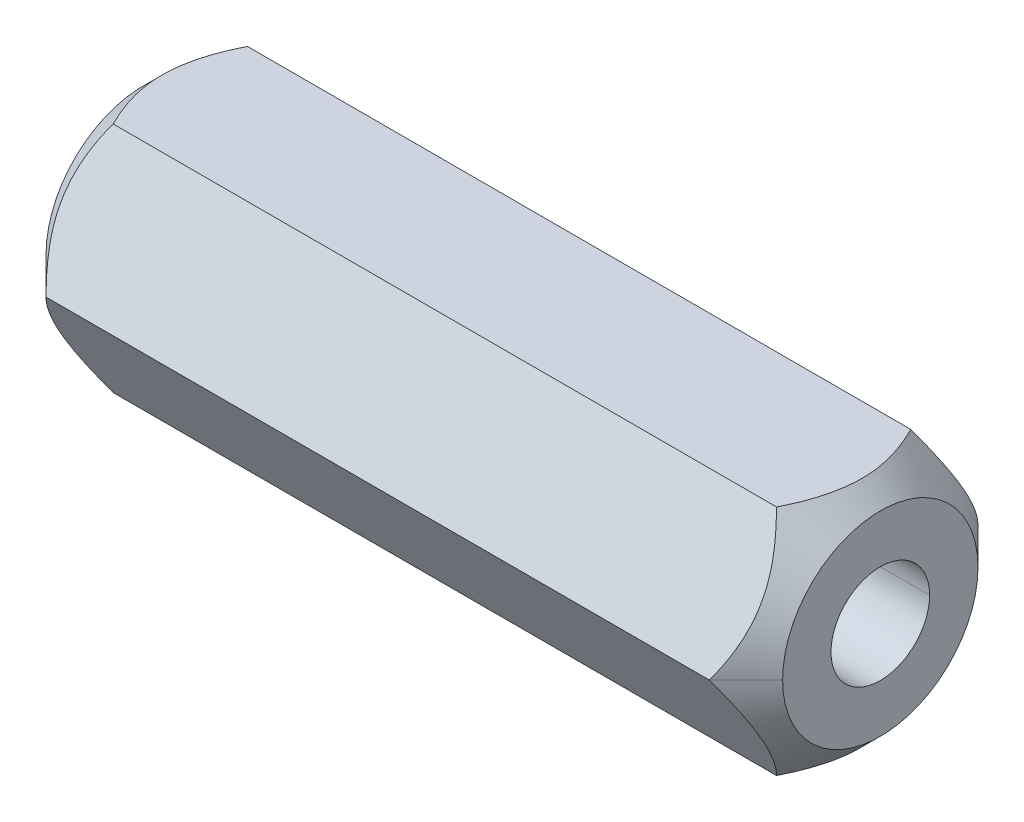
ISO-10303-21;
HEADER;
FILE_DESCRIPTION(('STEP AP214'),'2;1');
FILE_NAME('part.step','',(''),(''),'','','');
FILE_SCHEMA(('AUTOMOTIVE_DESIGN { 1 0 10303 214 1 1 1 1 }'));
ENDSEC;
DATA;
#1=APPLICATION_CONTEXT('core data for automotive mechanical design processes');
#2=APPLICATION_PROTOCOL_DEFINITION('international standard','automotive_design',2000,#1);
#3=PRODUCT_CONTEXT('',#1,'mechanical');
#4=PRODUCT('Part','Part','',(#3));
#5=PRODUCT_RELATED_PRODUCT_CATEGORY('part','',(#4));
#6=PRODUCT_DEFINITION_FORMATION('','',#4);
#7=PRODUCT_DEFINITION_CONTEXT('part definition',#1,'design');
#8=PRODUCT_DEFINITION('design','',#6,#7);
#9=PRODUCT_DEFINITION_SHAPE('','',#8);
#10=(LENGTH_UNIT() NAMED_UNIT(*) SI_UNIT(.MILLI.,.METRE.));
#11=(NAMED_UNIT(*) PLANE_ANGLE_UNIT() SI_UNIT($,.RADIAN.));
#12=(NAMED_UNIT(*) SI_UNIT($,.STERADIAN.) SOLID_ANGLE_UNIT());
#13=UNCERTAINTY_MEASURE_WITH_UNIT(LENGTH_MEASURE(1.E-05),#10,'distance_accuracy_value','');
#14=(GEOMETRIC_REPRESENTATION_CONTEXT(3) GLOBAL_UNCERTAINTY_ASSIGNED_CONTEXT((#13)) GLOBAL_UNIT_ASSIGNED_CONTEXT((#10,
#11,#12)) REPRESENTATION_CONTEXT('',''));
#15=CARTESIAN_POINT('',(0.,0.,0.));
#16=DIRECTION('',(0.,0.,1.));
#17=DIRECTION('',(1.,0.,0.));
#18=AXIS2_PLACEMENT_3D('',#15,#16,#17);
#19=CARTESIAN_POINT('',(15.08125,0.,0.));
#20=DIRECTION('',(-1.,0.,0.));
#21=DIRECTION('',(0.,0.,-1.));
#22=AXIS2_PLACEMENT_3D('',#19,#20,#21);
#23=CONICAL_SURFACE('',#22,4.,0.785398163397452);
#24=DIRECTION('',(-0.707106781186546,0.,0.70710678118655));
#25=VECTOR('',#24,1.);
#26=CARTESIAN_POINT('',(15.08125,0.,4.));
#27=LINE('',#26,#25);
#28=CARTESIAN_POINT('',(15.08125,0.,4.));
#29=VERTEX_POINT('',#28);
#30=CARTESIAN_POINT('',(13.5819886859688,0.,5.49926131403119));
#31=VERTEX_POINT('',#30);
#32=EDGE_CURVE('E331',#29,#31,#27,.T.);
#33=ORIENTED_EDGE('',*,*,#32,.F.);
#34=CARTESIAN_POINT('',(15.08125,0.,0.));
#35=DIRECTION('',(1.,0.,0.));
#36=DIRECTION('',(0.,0.,-1.));
#37=AXIS2_PLACEMENT_3D('',#34,#35,#36);
#38=CIRCLE('',#37,4.);
#39=CARTESIAN_POINT('',(15.08125,0.,-4.));
#40=VERTEX_POINT('',#39);
#41=EDGE_CURVE('E431',#40,#29,#38,.T.);
#42=ORIENTED_EDGE('',*,*,#41,.F.);
#43=DIRECTION('',(-0.707106781186544,0.,-0.707106781186551));
#44=VECTOR('',#43,1.);
#45=CARTESIAN_POINT('',(15.08125,0.,-4.));
#46=LINE('',#45,#44);
#47=CARTESIAN_POINT('',(13.5819886859688,0.,-5.49926131403117));
#48=VERTEX_POINT('',#47);
#49=EDGE_CURVE('E379',#40,#48,#46,.T.);
#50=ORIENTED_EDGE('',*,*,#49,.T.);
#51=CARTESIAN_POINT('',(13.5819886859688,4.76249999999998,-2.74963065701557));
#52=CARTESIAN_POINT('',(13.9295712015046,4.16046942326955,-3.09721317255128));
#53=CARTESIAN_POINT('',(14.1099813082947,3.6157861948308,-3.41168618111346));
#54=CARTESIAN_POINT('',(14.317184713866,2.99021026730595,-3.77286261126849));
#55=CARTESIAN_POINT('',(14.3187392405184,2.39001716223986,-4.11938426204415));
#56=CARTESIAN_POINT('',(14.3202942600487,1.78963376004912,-4.46601578091596));
#57=CARTESIAN_POINT('',(14.1152262690762,1.16264871796632,-4.82800576374033));
#58=CARTESIAN_POINT('',(13.9348623384729,0.611195094788861,-5.14638766152743));
#59=CARTESIAN_POINT('',(13.5819886859689,0.,-5.49926131403116));
#60=B_SPLINE_CURVE_WITH_KNOTS('',2,(#51,#52,#53,#54,#55,#56,#57,#58,#59),.UNSPECIFIED.,.F.,.F.,
(3,2,2,2,3),(0.,0.25,0.5,0.75,1.),.UNSPECIFIED.);
#61=CARTESIAN_POINT('',(13.5819886859688,4.7625,-2.74963065701558));
#62=VERTEX_POINT('',#61);
#63=EDGE_CURVE('E114',#62,#48,#60,.T.);
#64=ORIENTED_EDGE('',*,*,#63,.F.);
#65=CARTESIAN_POINT('',(13.5819886859688,4.76249999999998,2.74963065701558));
#66=CARTESIAN_POINT('',(13.9321394934116,4.76249999999998,2.04932904213029));
#67=CARTESIAN_POINT('',(14.112685608256,4.76249999999999,1.41605997927579));
#68=CARTESIAN_POINT('',(14.3186623628372,4.76249999999999,0.693592445394865));
#69=CARTESIAN_POINT('',(14.3187499997749,4.76249999999999,4.63096649951089E-05));
#70=CARTESIAN_POINT('',(14.3188374802402,4.76249999999999,-0.69226152636333));
#71=CARTESIAN_POINT('',(14.1128194285647,4.76249999999999,-1.41559036912996));
#72=CARTESIAN_POINT('',(13.9325551848368,4.7625,-2.04849765927974));
#73=CARTESIAN_POINT('',(13.5819886859688,4.7625,-2.74963065701558));
#74=B_SPLINE_CURVE_WITH_KNOTS('',2,(#65,#66,#67,#68,#69,#70,#71,#72,#73),.UNSPECIFIED.,.F.,.F.,
(3,2,2,2,3),(0.,0.25,0.5,0.75,1.),.UNSPECIFIED.);
#75=CARTESIAN_POINT('',(13.5819886859688,4.7625,2.74963065701558));
#76=VERTEX_POINT('',#75);
#77=EDGE_CURVE('E306',#76,#62,#74,.T.);
#78=ORIENTED_EDGE('',*,*,#77,.F.);
#79=CARTESIAN_POINT('',(13.5819886859688,0.,5.49926131403118));
#80=CARTESIAN_POINT('',(13.9295712015049,0.602030576730974,5.15167879849517));
#81=CARTESIAN_POINT('',(14.1099813082947,1.1467138051692,4.83720578993329));
#82=CARTESIAN_POINT('',(14.3171847138571,1.77228973266755,4.47602935979357));
#83=CARTESIAN_POINT('',(14.3187392405184,2.37248283776015,4.12950770900261));
#84=CARTESIAN_POINT('',(14.3202942600576,2.97286623992723,3.78287619014446));
#85=CARTESIAN_POINT('',(14.1152262690762,3.5998512820337,3.42088620730642));
#86=CARTESIAN_POINT('',(13.9348623384706,4.15130490521508,3.10250430951706));
#87=CARTESIAN_POINT('',(13.5819886859688,4.76250000000004,2.74963065701558));
#88=B_SPLINE_CURVE_WITH_KNOTS('',2,(#79,#80,#81,#82,#83,#84,#85,#86,#87),.UNSPECIFIED.,.F.,.F.,
(3,2,2,2,3),(0.,0.25,0.5,0.75,1.),.UNSPECIFIED.);
#89=EDGE_CURVE('E305',#31,#76,#88,.T.);
#90=ORIENTED_EDGE('',*,*,#89,.F.);
#91=EDGE_LOOP('',(#33,#42,#50,#64,#78,#90));
#92=FACE_BOUND('',#91,.T.);
#93=ADVANCED_FACE('F16',(#92),#23,.T.);
#94=CARTESIAN_POINT('',(-15.08125,0.,0.));
#95=DIRECTION('',(1.,0.,0.));
#96=DIRECTION('',(0.,0.,-1.));
#97=AXIS2_PLACEMENT_3D('',#94,#95,#96);
#98=CONICAL_SURFACE('',#97,4.,0.785398163397452);
#99=DIRECTION('',(0.707106781186546,0.,0.70710678118655));
#100=VECTOR('',#99,1.);
#101=CARTESIAN_POINT('',(-15.08125,0.,4.));
#102=LINE('',#101,#100);
#103=CARTESIAN_POINT('',(-15.08125,0.,4.));
#104=VERTEX_POINT('',#103);
#105=CARTESIAN_POINT('',(-13.5819886859688,0.,5.49926131403119));
#106=VERTEX_POINT('',#105);
#107=EDGE_CURVE('E309',#104,#106,#102,.T.);
#108=ORIENTED_EDGE('',*,*,#107,.F.);
#109=CARTESIAN_POINT('',(-15.08125,0.,0.));
#110=DIRECTION('',(1.,0.,0.));
#111=DIRECTION('',(0.,0.,-1.));
#112=AXIS2_PLACEMENT_3D('',#109,#110,#111);
#113=CIRCLE('',#112,4.);
#114=CARTESIAN_POINT('',(-15.08125,0.,-4.));
#115=VERTEX_POINT('',#114);
#116=EDGE_CURVE('E125',#104,#115,#113,.T.);
#117=ORIENTED_EDGE('',*,*,#116,.T.);
#118=DIRECTION('',(0.707106781186544,0.,-0.707106781186551));
#119=VECTOR('',#118,1.);
#120=CARTESIAN_POINT('',(-15.08125,0.,-4.));
#121=LINE('',#120,#119);
#122=CARTESIAN_POINT('',(-13.5819886859688,0.,-5.49926131403117));
#123=VERTEX_POINT('',#122);
#124=EDGE_CURVE('E172',#115,#123,#121,.T.);
#125=ORIENTED_EDGE('',*,*,#124,.T.);
#126=CARTESIAN_POINT('',(-13.5819886859689,-4.7625,-2.74963065701564));
#127=CARTESIAN_POINT('',(-13.9295712015054,-4.16046942326812,-3.09721317255218));
#128=CARTESIAN_POINT('',(-14.1099813082947,-3.61578619483082,-3.41168618111352));
#129=CARTESIAN_POINT('',(-14.3171847138593,-2.99021026732507,-3.77286261125752));
#130=CARTESIAN_POINT('',(-14.3187392405184,-2.3900171622399,-4.1193842620442));
#131=CARTESIAN_POINT('',(-14.3202942600554,-1.7896337600616,-4.46601578090882));
#132=CARTESIAN_POINT('',(-14.1152262690762,-1.16264871796637,-4.82800576374037));
#133=CARTESIAN_POINT('',(-13.9348623384677,-0.611195094779831,-5.14638766153271));
#134=CARTESIAN_POINT('',(-13.5819886859689,0.,-5.49926131403119));
#135=B_SPLINE_CURVE_WITH_KNOTS('',2,(#126,#127,#128,#129,#130,#131,#132,#133,#134),
.UNSPECIFIED.,.F.,.F.,(3,2,2,2,3),(0.,0.25,0.5,0.75,1.),.UNSPECIFIED.);
#136=CARTESIAN_POINT('',(-13.5819886859689,-4.7625,-2.74963065701564));
#137=VERTEX_POINT('',#136);
#138=EDGE_CURVE('E151',#137,#123,#135,.T.);
#139=ORIENTED_EDGE('',*,*,#138,.F.);
#140=CARTESIAN_POINT('',(-13.5819886859689,-4.7625,2.74963065701558));
#141=CARTESIAN_POINT('',(-13.9321394934045,-4.76249999999999,2.04932904214433));
#142=CARTESIAN_POINT('',(-14.112685608256,-4.76249999999999,1.41605997927577));
#143=CARTESIAN_POINT('',(-14.3186623628373,-4.76249999999998,0.693592445407265));
#144=CARTESIAN_POINT('',(-14.3187499997749,-4.76249999999997,4.63096649647513E-05));
#145=CARTESIAN_POINT('',(-14.3188374802402,-4.76249999999996,-0.69226152636777));
#146=CARTESIAN_POINT('',(-14.1128194285647,-4.76249999999996,-1.41559036913001));
#147=CARTESIAN_POINT('',(-13.9325551848343,-4.76249999999995,-2.04849765928481));
#148=CARTESIAN_POINT('',(-13.5819886859689,-4.76249999999994,-2.74963065701564));
#149=B_SPLINE_CURVE_WITH_KNOTS('',2,(#140,#141,#142,#143,#144,#145,#146,#147,#148),
.UNSPECIFIED.,.F.,.F.,(3,2,2,2,3),(0.,0.25,0.5,0.75,1.),.UNSPECIFIED.);
#150=CARTESIAN_POINT('',(-13.5819886859688,-4.7625,2.74963065701558));
#151=VERTEX_POINT('',#150);
#152=EDGE_CURVE('E11',#151,#137,#149,.T.);
#153=ORIENTED_EDGE('',*,*,#152,.F.);
#154=CARTESIAN_POINT('',(-13.5819886859689,0.,5.49926131403119));
#155=CARTESIAN_POINT('',(-13.9295712015043,-0.602030576730016,5.15167879849572));
#156=CARTESIAN_POINT('',(-14.1099813082947,-1.14671380516917,4.83720578993329));
#157=CARTESIAN_POINT('',(-14.3171847138571,-1.77228973266663,4.47602935979408));
#158=CARTESIAN_POINT('',(-14.3187392405184,-2.37248283776011,4.12950770900259));
#159=CARTESIAN_POINT('',(-14.3202942600576,-2.97286623992439,3.78287619014605));
#160=CARTESIAN_POINT('',(-14.1152262690762,-3.59985128203366,3.42088620730639));
#161=CARTESIAN_POINT('',(-13.9348623384725,-4.15130490521186,3.10250430951886));
#162=CARTESIAN_POINT('',(-13.5819886859689,-4.76249999999999,2.74963065701555));
#163=B_SPLINE_CURVE_WITH_KNOTS('',2,(#154,#155,#156,#157,#158,#159,#160,#161,#162),
.UNSPECIFIED.,.F.,.F.,(3,2,2,2,3),(0.,0.25,0.5,0.75,1.),.UNSPECIFIED.);
#164=EDGE_CURVE('E30',#106,#151,#163,.T.);
#165=ORIENTED_EDGE('',*,*,#164,.F.);
#166=EDGE_LOOP('',(#108,#117,#125,#139,#153,#165));
#167=FACE_BOUND('',#166,.T.);
#168=ADVANCED_FACE('F173',(#167),#98,.T.);
#169=CARTESIAN_POINT('',(15.08125,0.,0.));
#170=DIRECTION('',(1.,0.,0.));
#171=DIRECTION('',(0.,0.,-1.));
#172=AXIS2_PLACEMENT_3D('',#169,#170,#171);
#173=CYLINDRICAL_SURFACE('',#172,2.0193);
#174=DIRECTION('',(1.,0.,0.));
#175=VECTOR('',#174,1.);
#176=CARTESIAN_POINT('',(15.08125,0.,2.0193));
#177=LINE('',#176,#175);
#178=CARTESIAN_POINT('',(-15.08125,0.,2.0193));
#179=VERTEX_POINT('',#178);
#180=CARTESIAN_POINT('',(15.08125,0.,2.0193));
#181=VERTEX_POINT('',#180);
#182=EDGE_CURVE('E425',#179,#181,#177,.T.);
#183=ORIENTED_EDGE('',*,*,#182,.F.);
#184=CARTESIAN_POINT('',(-15.08125,0.,0.));
#185=DIRECTION('',(-1.,0.,0.));
#186=DIRECTION('',(0.,0.,1.));
#187=AXIS2_PLACEMENT_3D('',#184,#185,#186);
#188=CIRCLE('',#187,2.0193);
#189=CARTESIAN_POINT('',(-15.08125,0.,-2.0193));
#190=VERTEX_POINT('',#189);
#191=EDGE_CURVE('E170',#179,#190,#188,.T.);
#192=ORIENTED_EDGE('',*,*,#191,.T.);
#193=DIRECTION('',(1.,0.,0.));
#194=VECTOR('',#193,1.);
#195=CARTESIAN_POINT('',(15.08125,0.,-2.0193));
#196=LINE('',#195,#194);
#197=CARTESIAN_POINT('',(15.08125,0.,-2.0193));
#198=VERTEX_POINT('',#197);
#199=EDGE_CURVE('E428',#190,#198,#196,.T.);
#200=ORIENTED_EDGE('',*,*,#199,.T.);
#201=CARTESIAN_POINT('',(15.08125,0.,0.));
#202=DIRECTION('',(1.,0.,0.));
#203=DIRECTION('',(0.,0.,-1.));
#204=AXIS2_PLACEMENT_3D('',#201,#202,#203);
#205=CIRCLE('',#204,2.0193);
#206=EDGE_CURVE('E137',#198,#181,#205,.T.);
#207=ORIENTED_EDGE('',*,*,#206,.T.);
#208=EDGE_LOOP('',(#183,#192,#200,#207));
#209=FACE_BOUND('',#208,.T.);
#210=ADVANCED_FACE('F263',(#209),#173,.F.);
#211=CARTESIAN_POINT('',(15.08125,-4.7625,2.74963065701554));
#212=DIRECTION('',(0.,1.,0.));
#213=DIRECTION('',(0.,0.,-1.));
#214=AXIS2_PLACEMENT_3D('',#211,#212,#213);
#215=PLANE('',#214);
#216=DIRECTION('',(-1.,0.,0.));
#217=VECTOR('',#216,1.);
#218=CARTESIAN_POINT('',(15.08125,-4.7625,-2.74963065701564));
#219=LINE('',#218,#217);
#220=CARTESIAN_POINT('',(13.5819886859688,-4.7625,-2.74963065701565));
#221=VERTEX_POINT('',#220);
#222=EDGE_CURVE('E157',#221,#137,#219,.T.);
#223=ORIENTED_EDGE('',*,*,#222,.F.);
#224=CARTESIAN_POINT('',(13.5819886859688,-4.76249999999994,-2.74963065701565));
#225=CARTESIAN_POINT('',(13.9322680489546,-4.76249999999995,-2.04907193104417));
#226=CARTESIAN_POINT('',(14.1128194285647,-4.76249999999996,-1.41559036913003));
#227=CARTESIAN_POINT('',(14.3186756413312,-4.76249999999996,-0.69332441095962));
#228=CARTESIAN_POINT('',(14.3187499997749,-4.76249999999997,4.63096649296231E-05));
#229=CARTESIAN_POINT('',(14.3188242629396,-4.76249999999998,0.69252858122082));
#230=CARTESIAN_POINT('',(14.112685608256,-4.76249999999999,1.41605997927573));
#231=CARTESIAN_POINT('',(13.9324272011736,-4.76249999999999,2.04875362660598));
#232=CARTESIAN_POINT('',(13.5819886859689,-4.7625,2.74963065701554));
#233=B_SPLINE_CURVE_WITH_KNOTS('',2,(#224,#225,#226,#227,#228,#229,#230,#231,#232),
.UNSPECIFIED.,.F.,.F.,(3,2,2,2,3),(0.,0.25,0.5,0.75,1.),.UNSPECIFIED.);
#234=CARTESIAN_POINT('',(13.5819886859689,-4.7625,2.74963065701554));
#235=VERTEX_POINT('',#234);
#236=EDGE_CURVE('E390',#221,#235,#233,.T.);
#237=ORIENTED_EDGE('',*,*,#236,.T.);
#238=DIRECTION('',(-1.,0.,0.));
#239=VECTOR('',#238,1.);
#240=CARTESIAN_POINT('',(15.08125,-4.7625,2.74963065701554));
#241=LINE('',#240,#239);
#242=EDGE_CURVE('E453',#235,#151,#241,.T.);
#243=ORIENTED_EDGE('',*,*,#242,.T.);
#244=ORIENTED_EDGE('',*,*,#152,.T.);
#245=EDGE_LOOP('',(#223,#237,#243,#244));
#246=FACE_BOUND('',#245,.T.);
#247=ADVANCED_FACE('F208',(#246),#215,.F.);
#248=CARTESIAN_POINT('',(15.08125,0.,5.49926131403116));
#249=DIRECTION('',(0.,0.500000000000007,-0.866025403784435));
#250=DIRECTION('',(-1.,0.,0.));
#251=AXIS2_PLACEMENT_3D('',#248,#249,#250);
#252=PLANE('',#251);
#253=ORIENTED_EDGE('',*,*,#242,.F.);
#254=CARTESIAN_POINT('',(13.5819886859689,-4.7625,2.74963065701554));
#255=CARTESIAN_POINT('',(13.9295712014971,-4.16046942328253,3.09721317254376));
#256=CARTESIAN_POINT('',(14.1099813082947,-3.61578619483082,3.41168618111344));
#257=CARTESIAN_POINT('',(14.3171847138559,-2.99021026734756,3.77286261124445));
#258=CARTESIAN_POINT('',(14.3187392405184,-2.39001716223987,4.11938426204414));
#259=CARTESIAN_POINT('',(14.3202942600587,-1.78963376007553,4.46601578090071));
#260=CARTESIAN_POINT('',(14.1152262690762,-1.16264871796632,4.82800576374034));
#261=CARTESIAN_POINT('',(13.9348623384702,-0.611195094784165,5.14638766153016));
#262=CARTESIAN_POINT('',(13.5819886859688,0.,5.49926131403119));
#263=B_SPLINE_CURVE_WITH_KNOTS('',2,(#254,#255,#256,#257,#258,#259,#260,#261,#262),
.UNSPECIFIED.,.F.,.F.,(3,2,2,2,3),(0.,0.25,0.5,0.75,1.),.UNSPECIFIED.);
#264=EDGE_CURVE('E395',#235,#31,#263,.T.);
#265=ORIENTED_EDGE('',*,*,#264,.T.);
#266=DIRECTION('',(-1.,0.,0.));
#267=VECTOR('',#266,1.);
#268=CARTESIAN_POINT('',(15.08125,0.,5.49926131403116));
#269=LINE('',#268,#267);
#270=EDGE_CURVE('E297',#31,#106,#269,.T.);
#271=ORIENTED_EDGE('',*,*,#270,.T.);
#272=ORIENTED_EDGE('',*,*,#164,.T.);
#273=EDGE_LOOP('',(#253,#265,#271,#272));
#274=FACE_BOUND('',#273,.T.);
#275=ADVANCED_FACE('F341',(#274),#252,.F.);
#276=CARTESIAN_POINT('',(15.08125,4.7625,2.7496306570156));
#277=DIRECTION('',(0.,-0.5,-0.866025403784442));
#278=DIRECTION('',(0.,-0.866025403784442,0.5));
#279=AXIS2_PLACEMENT_3D('',#276,#277,#278);
#280=PLANE('',#279);
#281=ORIENTED_EDGE('',*,*,#270,.F.);
#282=ORIENTED_EDGE('',*,*,#89,.T.);
#283=DIRECTION('',(-1.,0.,0.));
#284=VECTOR('',#283,1.);
#285=CARTESIAN_POINT('',(15.08125,4.7625,2.7496306570156));
#286=LINE('',#285,#284);
#287=CARTESIAN_POINT('',(-13.5819886859688,4.7625,2.74963065701558));
#288=VERTEX_POINT('',#287);
#289=EDGE_CURVE('E73',#76,#288,#286,.T.);
#290=ORIENTED_EDGE('',*,*,#289,.T.);
#291=CARTESIAN_POINT('',(-13.581988685969,4.76250000000004,2.74963065701558));
#292=CARTESIAN_POINT('',(-13.9295712015002,4.1604694232774,3.09721317254678));
#293=CARTESIAN_POINT('',(-14.1099813082949,3.61578619483085,3.41168618111347));
#294=CARTESIAN_POINT('',(-14.3171847138572,2.99021026733975,3.77286261124901));
#295=CARTESIAN_POINT('',(-14.3187392405186,2.3900171622399,4.11938426204416));
#296=CARTESIAN_POINT('',(-14.3202942600578,1.78963376006835,4.46601578090488));
#297=CARTESIAN_POINT('',(-14.1152262690764,1.16264871796635,4.82800576374035));
#298=CARTESIAN_POINT('',(-13.9348623384678,0.611195094779683,5.14638766153276));
#299=CARTESIAN_POINT('',(-13.581988685969,0.,5.49926131403118));
#300=B_SPLINE_CURVE_WITH_KNOTS('',2,(#291,#292,#293,#294,#295,#296,#297,#298,#299),
.UNSPECIFIED.,.F.,.F.,(3,2,2,2,3),(0.,0.25,0.5,0.75,1.),.UNSPECIFIED.);
#301=EDGE_CURVE('E225',#288,#106,#300,.T.);
#302=ORIENTED_EDGE('',*,*,#301,.T.);
#303=EDGE_LOOP('',(#281,#282,#290,#302));
#304=FACE_BOUND('',#303,.T.);
#305=ADVANCED_FACE('F18',(#304),#280,.F.);
#306=CARTESIAN_POINT('',(15.08125,4.7625,-2.74963065701557));
#307=DIRECTION('',(0.,-1.,0.));
#308=DIRECTION('',(0.,0.,-1.));
#309=AXIS2_PLACEMENT_3D('',#306,#307,#308);
#310=PLANE('',#309);
#311=ORIENTED_EDGE('',*,*,#289,.F.);
#312=ORIENTED_EDGE('',*,*,#77,.T.);
#313=DIRECTION('',(-1.,0.,0.));
#314=VECTOR('',#313,1.);
#315=CARTESIAN_POINT('',(15.08125,4.7625,-2.74963065701557));
#316=LINE('',#315,#314);
#317=CARTESIAN_POINT('',(-13.5819886859688,4.7625,-2.74963065701558));
#318=VERTEX_POINT('',#317);
#319=EDGE_CURVE('E160',#62,#318,#316,.T.);
#320=ORIENTED_EDGE('',*,*,#319,.T.);
#321=CARTESIAN_POINT('',(-13.5819886859689,4.7625,-2.74963065701558));
#322=CARTESIAN_POINT('',(-13.9322680489545,4.7625,-2.04907193104424));
#323=CARTESIAN_POINT('',(-14.1128194285647,4.76249999999999,-1.41559036912996));
#324=CARTESIAN_POINT('',(-14.318675641329,4.76249999999999,-0.69332441096739));
#325=CARTESIAN_POINT('',(-14.3187499997749,4.76249999999999,4.63096649903384E-05));
#326=CARTESIAN_POINT('',(-14.3188242629418,4.76249999999999,0.692528581213355));
#327=CARTESIAN_POINT('',(-14.112685608256,4.76249999999999,1.41605997927579));
#328=CARTESIAN_POINT('',(-13.9324272011735,4.76249999999998,2.04875362660653));
#329=CARTESIAN_POINT('',(-13.5819886859689,4.76249999999998,2.74963065701558));
#330=B_SPLINE_CURVE_WITH_KNOTS('',2,(#321,#322,#323,#324,#325,#326,#327,#328,#329),
.UNSPECIFIED.,.F.,.F.,(3,2,2,2,3),(0.,0.25,0.5,0.75,1.),.UNSPECIFIED.);
#331=EDGE_CURVE('E183',#318,#288,#330,.T.);
#332=ORIENTED_EDGE('',*,*,#331,.T.);
#333=EDGE_LOOP('',(#311,#312,#320,#332));
#334=FACE_BOUND('',#333,.T.);
#335=ADVANCED_FACE('F474',(#334),#310,.F.);
#336=CARTESIAN_POINT('',(15.08125,0.,-5.49926131403116));
#337=DIRECTION('',(0.,-0.5,0.866025403784438));
#338=DIRECTION('',(-1.,0.,0.));
#339=AXIS2_PLACEMENT_3D('',#336,#337,#338);
#340=PLANE('',#339);
#341=ORIENTED_EDGE('',*,*,#319,.F.);
#342=ORIENTED_EDGE('',*,*,#63,.T.);
#343=DIRECTION('',(-1.,0.,0.));
#344=VECTOR('',#343,1.);
#345=CARTESIAN_POINT('',(15.08125,0.,-5.49926131403116));
#346=LINE('',#345,#344);
#347=EDGE_CURVE('E155',#48,#123,#346,.T.);
#348=ORIENTED_EDGE('',*,*,#347,.T.);
#349=CARTESIAN_POINT('',(-13.5819886859689,0.,-5.49926131403116));
#350=CARTESIAN_POINT('',(-13.9295712014948,0.602030576713622,-5.15167879850516));
#351=CARTESIAN_POINT('',(-14.1099813082947,1.14671380516918,-4.83720578993327));
#352=CARTESIAN_POINT('',(-14.3171847138593,1.77228973265927,-4.47602935979832));
#353=CARTESIAN_POINT('',(-14.3187392405184,2.37248283776012,-4.12950770900259));
#354=CARTESIAN_POINT('',(-14.3202942600554,2.97286623993789,-3.78287619013827));
#355=CARTESIAN_POINT('',(-14.1152262690762,3.59985128203366,-3.4208862073064));
#356=CARTESIAN_POINT('',(-13.934862338468,4.15130490521965,-3.10250430951438));
#357=CARTESIAN_POINT('',(-13.5819886859689,4.76249999999998,-2.74963065701557));
#358=B_SPLINE_CURVE_WITH_KNOTS('',2,(#349,#350,#351,#352,#353,#354,#355,#356,#357),
.UNSPECIFIED.,.F.,.F.,(3,2,2,2,3),(0.,0.25,0.5,0.75,1.),.UNSPECIFIED.);
#359=EDGE_CURVE('E166',#123,#318,#358,.T.);
#360=ORIENTED_EDGE('',*,*,#359,.T.);
#361=EDGE_LOOP('',(#341,#342,#348,#360));
#362=FACE_BOUND('',#361,.T.);
#363=ADVANCED_FACE('F164',(#362),#340,.F.);
#364=CARTESIAN_POINT('',(15.08125,-4.7625,-2.74963065701564));
#365=DIRECTION('',(0.,0.5,0.866025403784442));
#366=DIRECTION('',(1.,0.,0.));
#367=AXIS2_PLACEMENT_3D('',#364,#365,#366);
#368=PLANE('',#367);
#369=ORIENTED_EDGE('',*,*,#347,.F.);
#370=CARTESIAN_POINT('',(13.5819886859689,0.,-5.49926131403119));
#371=CARTESIAN_POINT('',(13.9295712015046,-0.602030576730498,-5.15167879849549));
#372=CARTESIAN_POINT('',(14.1099813082947,-1.14671380516922,-4.83720578993332));
#373=CARTESIAN_POINT('',(14.3171847138615,-1.77228973268055,-4.4760293597861));
#374=CARTESIAN_POINT('',(14.3187392405184,-2.37248283776015,-4.12950770900264));
#375=CARTESIAN_POINT('',(14.3202942600531,-2.97286623993796,-3.7828761901383));
#376=CARTESIAN_POINT('',(14.1152262690762,-3.59985128203368,-3.42088620730646));
#377=CARTESIAN_POINT('',(13.9348623384725,-4.15130490521181,-3.10250430951898));
#378=CARTESIAN_POINT('',(13.5819886859688,-4.76249999999999,-2.74963065701564));
#379=B_SPLINE_CURVE_WITH_KNOTS('',2,(#370,#371,#372,#373,#374,#375,#376,#377,#378),
.UNSPECIFIED.,.F.,.F.,(3,2,2,2,3),(0.,0.25,0.5,0.75,1.),.UNSPECIFIED.);
#380=EDGE_CURVE('E245',#48,#221,#379,.T.);
#381=ORIENTED_EDGE('',*,*,#380,.T.);
#382=ORIENTED_EDGE('',*,*,#222,.T.);
#383=ORIENTED_EDGE('',*,*,#138,.T.);
#384=EDGE_LOOP('',(#369,#381,#382,#383));
#385=FACE_BOUND('',#384,.T.);
#386=ADVANCED_FACE('F153',(#385),#368,.F.);
#387=CARTESIAN_POINT('',(-15.08125,0.,0.));
#388=DIRECTION('',(1.,0.,0.));
#389=DIRECTION('',(0.,1.,0.));
#390=AXIS2_PLACEMENT_3D('',#387,#388,#389);
#391=PLANE('',#390);
#392=CARTESIAN_POINT('',(-15.08125,0.,0.));
#393=DIRECTION('',(-1.,0.,0.));
#394=DIRECTION('',(0.,0.,1.));
#395=AXIS2_PLACEMENT_3D('',#392,#393,#394);
#396=CIRCLE('',#395,2.0193);
#397=EDGE_CURVE('E178',#190,#179,#396,.T.);
#398=ORIENTED_EDGE('',*,*,#397,.F.);
#399=ORIENTED_EDGE('',*,*,#191,.F.);
#400=EDGE_LOOP('',(#398,#399));
#401=FACE_BOUND('',#400,.T.);
#402=CARTESIAN_POINT('',(-15.08125,0.,0.));
#403=DIRECTION('',(1.,0.,0.));
#404=DIRECTION('',(0.,0.,-1.));
#405=AXIS2_PLACEMENT_3D('',#402,#403,#404);
#406=CIRCLE('',#405,4.);
#407=EDGE_CURVE('E312',#115,#104,#406,.T.);
#408=ORIENTED_EDGE('',*,*,#407,.F.);
#409=ORIENTED_EDGE('',*,*,#116,.F.);
#410=EDGE_LOOP('',(#408,#409));
#411=FACE_BOUND('',#410,.T.);
#412=ADVANCED_FACE('F261',(#401,#411),#391,.F.);
#413=CARTESIAN_POINT('',(15.08125,0.,0.));
#414=DIRECTION('',(1.,0.,0.));
#415=DIRECTION('',(0.,1.,0.));
#416=AXIS2_PLACEMENT_3D('',#413,#414,#415);
#417=PLANE('',#416);
#418=ORIENTED_EDGE('',*,*,#206,.F.);
#419=CARTESIAN_POINT('',(15.08125,0.,0.));
#420=DIRECTION('',(1.,0.,0.));
#421=DIRECTION('',(0.,0.,-1.));
#422=AXIS2_PLACEMENT_3D('',#419,#420,#421);
#423=CIRCLE('',#422,2.0193);
#424=EDGE_CURVE('E432',#181,#198,#423,.T.);
#425=ORIENTED_EDGE('',*,*,#424,.F.);
#426=EDGE_LOOP('',(#418,#425));
#427=FACE_BOUND('',#426,.T.);
#428=ORIENTED_EDGE('',*,*,#41,.T.);
#429=CARTESIAN_POINT('',(15.08125,0.,0.));
#430=DIRECTION('',(1.,0.,0.));
#431=DIRECTION('',(0.,0.,-1.));
#432=AXIS2_PLACEMENT_3D('',#429,#430,#431);
#433=CIRCLE('',#432,4.);
#434=EDGE_CURVE('E410',#29,#40,#433,.T.);
#435=ORIENTED_EDGE('',*,*,#434,.T.);
#436=EDGE_LOOP('',(#428,#435));
#437=FACE_BOUND('',#436,.T.);
#438=ADVANCED_FACE('F262',(#427,#437),#417,.T.);
#439=CARTESIAN_POINT('',(15.08125,0.,0.));
#440=DIRECTION('',(1.,0.,0.));
#441=DIRECTION('',(0.,0.,-1.));
#442=AXIS2_PLACEMENT_3D('',#439,#440,#441);
#443=CYLINDRICAL_SURFACE('',#442,2.0193);
#444=ORIENTED_EDGE('',*,*,#397,.T.);
#445=ORIENTED_EDGE('',*,*,#182,.T.);
#446=ORIENTED_EDGE('',*,*,#424,.T.);
#447=ORIENTED_EDGE('',*,*,#199,.F.);
#448=EDGE_LOOP('',(#444,#445,#446,#447));
#449=FACE_BOUND('',#448,.T.);
#450=ADVANCED_FACE('F205',(#449),#443,.F.);
#451=CARTESIAN_POINT('',(-15.08125,0.,0.));
#452=DIRECTION('',(1.,0.,0.));
#453=DIRECTION('',(0.,0.,-1.));
#454=AXIS2_PLACEMENT_3D('',#451,#452,#453);
#455=CONICAL_SURFACE('',#454,4.,0.785398163397452);
#456=ORIENTED_EDGE('',*,*,#407,.T.);
#457=ORIENTED_EDGE('',*,*,#107,.T.);
#458=ORIENTED_EDGE('',*,*,#301,.F.);
#459=ORIENTED_EDGE('',*,*,#331,.F.);
#460=ORIENTED_EDGE('',*,*,#359,.F.);
#461=ORIENTED_EDGE('',*,*,#124,.F.);
#462=EDGE_LOOP('',(#456,#457,#458,#459,#460,#461));
#463=FACE_BOUND('',#462,.T.);
#464=ADVANCED_FACE('F181',(#463),#455,.T.);
#465=CARTESIAN_POINT('',(15.08125,0.,0.));
#466=DIRECTION('',(-1.,0.,0.));
#467=DIRECTION('',(0.,0.,-1.));
#468=AXIS2_PLACEMENT_3D('',#465,#466,#467);
#469=CONICAL_SURFACE('',#468,4.,0.785398163397452);
#470=ORIENTED_EDGE('',*,*,#434,.F.);
#471=ORIENTED_EDGE('',*,*,#32,.T.);
#472=ORIENTED_EDGE('',*,*,#264,.F.);
#473=ORIENTED_EDGE('',*,*,#236,.F.);
#474=ORIENTED_EDGE('',*,*,#380,.F.);
#475=ORIENTED_EDGE('',*,*,#49,.F.);
#476=EDGE_LOOP('',(#470,#471,#472,#473,#474,#475));
#477=FACE_BOUND('',#476,.T.);
#478=ADVANCED_FACE('F204',(#477),#469,.T.);
#479=CLOSED_SHELL('',(#93,#168,#210,#247,#275,#305,#335,#363,#386,#412,#438,#450,#464,#478));
#480=MANIFOLD_SOLID_BREP('B1',#479);
#481=ADVANCED_BREP_SHAPE_REPRESENTATION('',(#18,#480),#14);
#482=SHAPE_DEFINITION_REPRESENTATION(#9,#481);
ENDSEC;
END-ISO-10303-21;
